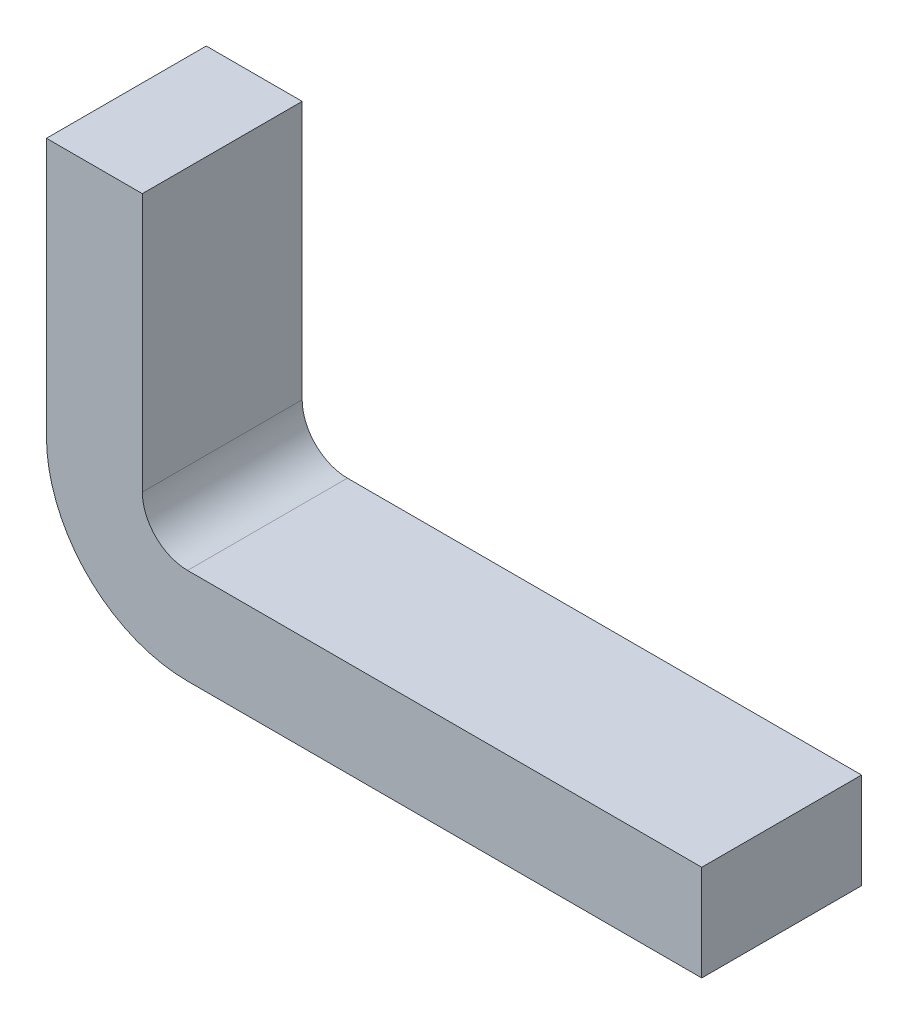
ISO-10303-21;
HEADER;
FILE_DESCRIPTION(('STEP AP214'),'2;1');
FILE_NAME('part.step','',(''),(''),'','','');
FILE_SCHEMA(('AUTOMOTIVE_DESIGN { 1 0 10303 214 1 1 1 1 }'));
ENDSEC;
DATA;
#1=APPLICATION_CONTEXT('core data for automotive mechanical design processes');
#2=APPLICATION_PROTOCOL_DEFINITION('international standard','automotive_design',2000,#1);
#3=PRODUCT_CONTEXT('',#1,'mechanical');
#4=PRODUCT('Part','Part','',(#3));
#5=PRODUCT_RELATED_PRODUCT_CATEGORY('part','',(#4));
#6=PRODUCT_DEFINITION_FORMATION('','',#4);
#7=PRODUCT_DEFINITION_CONTEXT('part definition',#1,'design');
#8=PRODUCT_DEFINITION('design','',#6,#7);
#9=PRODUCT_DEFINITION_SHAPE('','',#8);
#10=(LENGTH_UNIT() NAMED_UNIT(*) SI_UNIT(.MILLI.,.METRE.));
#11=(NAMED_UNIT(*) PLANE_ANGLE_UNIT() SI_UNIT($,.RADIAN.));
#12=(NAMED_UNIT(*) SI_UNIT($,.STERADIAN.) SOLID_ANGLE_UNIT());
#13=UNCERTAINTY_MEASURE_WITH_UNIT(LENGTH_MEASURE(1.E-05),#10,'distance_accuracy_value','');
#14=(GEOMETRIC_REPRESENTATION_CONTEXT(3) GLOBAL_UNCERTAINTY_ASSIGNED_CONTEXT((#13)) GLOBAL_UNIT_ASSIGNED_CONTEXT((#10,
#11,#12)) REPRESENTATION_CONTEXT('',''));
#15=CARTESIAN_POINT('',(0.,0.,0.));
#16=DIRECTION('',(0.,0.,1.));
#17=DIRECTION('',(1.,0.,0.));
#18=AXIS2_PLACEMENT_3D('',#15,#16,#17);
#19=CARTESIAN_POINT('',(1.89999999999999,0.300000000012247,0.25));
#20=DIRECTION('',(-1.,0.,0.));
#21=DIRECTION('',(0.,0.,1.));
#22=AXIS2_PLACEMENT_3D('',#19,#20,#21);
#23=PLANE('',#22);
#24=DIRECTION('',(0.,0.,-1.));
#25=VECTOR('',#24,1.);
#26=CARTESIAN_POINT('',(1.89999999999999,0.,0.25));
#27=LINE('',#26,#25);
#28=CARTESIAN_POINT('',(1.89999999999999,0.,0.25));
#29=VERTEX_POINT('',#28);
#30=CARTESIAN_POINT('',(1.89999999999999,0.,-0.25));
#31=VERTEX_POINT('',#30);
#32=EDGE_CURVE('E121',#29,#31,#27,.T.);
#33=ORIENTED_EDGE('',*,*,#32,.T.);
#34=DIRECTION('',(0.,1.,0.));
#35=VECTOR('',#34,1.);
#36=CARTESIAN_POINT('',(1.89999999999999,0.300000000012247,-0.25));
#37=LINE('',#36,#35);
#38=CARTESIAN_POINT('',(1.89999999999999,0.300000000012247,-0.25));
#39=VERTEX_POINT('',#38);
#40=EDGE_CURVE('E114',#31,#39,#37,.T.);
#41=ORIENTED_EDGE('',*,*,#40,.T.);
#42=DIRECTION('',(0.,0.,-1.));
#43=VECTOR('',#42,1.);
#44=CARTESIAN_POINT('',(1.89999999999999,0.300000000012247,0.25));
#45=LINE('',#44,#43);
#46=CARTESIAN_POINT('',(1.89999999999999,0.300000000012247,0.25));
#47=VERTEX_POINT('',#46);
#48=EDGE_CURVE('E11',#47,#39,#45,.T.);
#49=ORIENTED_EDGE('',*,*,#48,.F.);
#50=DIRECTION('',(0.,1.,0.));
#51=VECTOR('',#50,1.);
#52=CARTESIAN_POINT('',(1.89999999999999,0.300000000012247,0.25));
#53=LINE('',#52,#51);
#54=EDGE_CURVE('E148',#29,#47,#53,.T.);
#55=ORIENTED_EDGE('',*,*,#54,.F.);
#56=EDGE_LOOP('',(#33,#41,#49,#55));
#57=FACE_BOUND('',#56,.T.);
#58=ADVANCED_FACE('F37',(#57),#23,.F.);
#59=CARTESIAN_POINT('',(1.89999999999999,0.300000000012247,0.25));
#60=DIRECTION('',(0.,-1.,0.));
#61=DIRECTION('',(1.,0.,0.));
#62=AXIS2_PLACEMENT_3D('',#59,#60,#61);
#63=PLANE('',#62);
#64=ORIENTED_EDGE('',*,*,#48,.T.);
#65=DIRECTION('',(-1.,0.,0.));
#66=VECTOR('',#65,1.);
#67=CARTESIAN_POINT('',(1.89999999999999,0.300000000012247,-0.25));
#68=LINE('',#67,#66);
#69=CARTESIAN_POINT('',(0.291547594745416,0.300000000012247,-0.25));
#70=VERTEX_POINT('',#69);
#71=EDGE_CURVE('E104',#39,#70,#68,.T.);
#72=ORIENTED_EDGE('',*,*,#71,.T.);
#73=DIRECTION('',(0.,0.,-1.));
#74=VECTOR('',#73,1.);
#75=CARTESIAN_POINT('',(0.291547594745416,0.300000000012247,0.25));
#76=LINE('',#75,#74);
#77=CARTESIAN_POINT('',(0.291547594745416,0.300000000012247,0.25));
#78=VERTEX_POINT('',#77);
#79=EDGE_CURVE('E45',#78,#70,#76,.T.);
#80=ORIENTED_EDGE('',*,*,#79,.F.);
#81=DIRECTION('',(-1.,0.,0.));
#82=VECTOR('',#81,1.);
#83=CARTESIAN_POINT('',(1.89999999999999,0.300000000012247,0.25));
#84=LINE('',#83,#82);
#85=EDGE_CURVE('E105',#47,#78,#84,.T.);
#86=ORIENTED_EDGE('',*,*,#85,.F.);
#87=EDGE_LOOP('',(#64,#72,#80,#86));
#88=FACE_BOUND('',#87,.T.);
#89=ADVANCED_FACE('F102',(#88),#63,.F.);
#90=CARTESIAN_POINT('',(0.291547594745416,0.441547594751539,0.25));
#91=DIRECTION('',(0.,0.,-1.));
#92=DIRECTION('',(-1.,0.,0.));
#93=AXIS2_PLACEMENT_3D('',#90,#91,#92);
#94=CYLINDRICAL_SURFACE('',#93,0.141547594739293);
#95=ORIENTED_EDGE('',*,*,#79,.T.);
#96=CARTESIAN_POINT('',(0.291547594745416,0.441547594751539,-0.25));
#97=DIRECTION('',(0.,0.,-1.));
#98=DIRECTION('',(-1.,0.,0.));
#99=AXIS2_PLACEMENT_3D('',#96,#97,#98);
#100=CIRCLE('',#99,0.141547594739293);
#101=CARTESIAN_POINT('',(0.150000000006123,0.441547594751539,-0.25));
#102=VERTEX_POINT('',#101);
#103=EDGE_CURVE('E118',#70,#102,#100,.T.);
#104=ORIENTED_EDGE('',*,*,#103,.T.);
#105=DIRECTION('',(0.,0.,-1.));
#106=VECTOR('',#105,1.);
#107=CARTESIAN_POINT('',(0.150000000006123,0.441547594751539,0.25));
#108=LINE('',#107,#106);
#109=CARTESIAN_POINT('',(0.150000000006123,0.441547594751539,0.25));
#110=VERTEX_POINT('',#109);
#111=EDGE_CURVE('E181',#110,#102,#108,.T.);
#112=ORIENTED_EDGE('',*,*,#111,.F.);
#113=CARTESIAN_POINT('',(0.291547594745416,0.441547594751539,0.25));
#114=DIRECTION('',(0.,0.,-1.));
#115=DIRECTION('',(-1.,0.,0.));
#116=AXIS2_PLACEMENT_3D('',#113,#114,#115);
#117=CIRCLE('',#116,0.141547594739293);
#118=EDGE_CURVE('E153',#78,#110,#117,.T.);
#119=ORIENTED_EDGE('',*,*,#118,.F.);
#120=EDGE_LOOP('',(#95,#104,#112,#119));
#121=FACE_BOUND('',#120,.T.);
#122=ADVANCED_FACE('F186',(#121),#94,.F.);
#123=CARTESIAN_POINT('',(0.150000000006123,0.441547594751539,0.25));
#124=DIRECTION('',(-1.,0.,0.));
#125=DIRECTION('',(0.,-1.,0.));
#126=AXIS2_PLACEMENT_3D('',#123,#124,#125);
#127=PLANE('',#126);
#128=ORIENTED_EDGE('',*,*,#111,.T.);
#129=DIRECTION('',(0.,1.,0.));
#130=VECTOR('',#129,1.);
#131=CARTESIAN_POINT('',(0.150000000006123,0.441547594751539,-0.25));
#132=LINE('',#131,#130);
#133=CARTESIAN_POINT('',(0.150000000006123,1.25000000002449,-0.25));
#134=VERTEX_POINT('',#133);
#135=EDGE_CURVE('E129',#102,#134,#132,.T.);
#136=ORIENTED_EDGE('',*,*,#135,.T.);
#137=DIRECTION('',(0.,0.,-1.));
#138=VECTOR('',#137,1.);
#139=CARTESIAN_POINT('',(0.150000000006123,1.25000000002449,0.25));
#140=LINE('',#139,#138);
#141=CARTESIAN_POINT('',(0.150000000006123,1.25000000002449,0.25));
#142=VERTEX_POINT('',#141);
#143=EDGE_CURVE('E178',#142,#134,#140,.T.);
#144=ORIENTED_EDGE('',*,*,#143,.F.);
#145=DIRECTION('',(0.,1.,0.));
#146=VECTOR('',#145,1.);
#147=CARTESIAN_POINT('',(0.150000000006123,0.441547594751539,0.25));
#148=LINE('',#147,#146);
#149=EDGE_CURVE('E156',#110,#142,#148,.T.);
#150=ORIENTED_EDGE('',*,*,#149,.F.);
#151=EDGE_LOOP('',(#128,#136,#144,#150));
#152=FACE_BOUND('',#151,.T.);
#153=ADVANCED_FACE('F194',(#152),#127,.F.);
#154=CARTESIAN_POINT('',(0.150000000006123,1.25000000002449,0.25));
#155=DIRECTION('',(0.,-1.,0.));
#156=DIRECTION('',(0.,0.,-1.));
#157=AXIS2_PLACEMENT_3D('',#154,#155,#156);
#158=PLANE('',#157);
#159=ORIENTED_EDGE('',*,*,#143,.T.);
#160=DIRECTION('',(-1.,0.,0.));
#161=VECTOR('',#160,1.);
#162=CARTESIAN_POINT('',(0.150000000006123,1.25000000002449,-0.25));
#163=LINE('',#162,#161);
#164=CARTESIAN_POINT('',(-0.150000000006124,1.25000000002449,-0.25));
#165=VERTEX_POINT('',#164);
#166=EDGE_CURVE('E133',#134,#165,#163,.T.);
#167=ORIENTED_EDGE('',*,*,#166,.T.);
#168=DIRECTION('',(0.,0.,-1.));
#169=VECTOR('',#168,1.);
#170=CARTESIAN_POINT('',(-0.150000000006124,1.25000000002449,0.25));
#171=LINE('',#170,#169);
#172=CARTESIAN_POINT('',(-0.150000000006124,1.25000000002449,0.25));
#173=VERTEX_POINT('',#172);
#174=EDGE_CURVE('E175',#173,#165,#171,.T.);
#175=ORIENTED_EDGE('',*,*,#174,.F.);
#176=DIRECTION('',(-1.,0.,0.));
#177=VECTOR('',#176,1.);
#178=CARTESIAN_POINT('',(0.150000000006123,1.25000000002449,0.25));
#179=LINE('',#178,#177);
#180=EDGE_CURVE('E159',#142,#173,#179,.T.);
#181=ORIENTED_EDGE('',*,*,#180,.F.);
#182=EDGE_LOOP('',(#159,#167,#175,#181));
#183=FACE_BOUND('',#182,.T.);
#184=ADVANCED_FACE('F197',(#183),#158,.F.);
#185=CARTESIAN_POINT('',(-0.150000000006123,0.441547594751539,0.25));
#186=DIRECTION('',(1.,0.,0.));
#187=DIRECTION('',(0.,1.,0.));
#188=AXIS2_PLACEMENT_3D('',#185,#186,#187);
#189=PLANE('',#188);
#190=ORIENTED_EDGE('',*,*,#174,.T.);
#191=DIRECTION('',(0.,-1.,0.));
#192=VECTOR('',#191,1.);
#193=CARTESIAN_POINT('',(-0.150000000006123,0.441547594751539,-0.25));
#194=LINE('',#193,#192);
#195=CARTESIAN_POINT('',(-0.150000000006123,0.441547594751539,-0.25));
#196=VERTEX_POINT('',#195);
#197=EDGE_CURVE('E137',#165,#196,#194,.T.);
#198=ORIENTED_EDGE('',*,*,#197,.T.);
#199=DIRECTION('',(0.,0.,-1.));
#200=VECTOR('',#199,1.);
#201=CARTESIAN_POINT('',(-0.150000000006123,0.441547594751539,0.25));
#202=LINE('',#201,#200);
#203=CARTESIAN_POINT('',(-0.150000000006123,0.441547594751539,0.25));
#204=VERTEX_POINT('',#203);
#205=EDGE_CURVE('E172',#204,#196,#202,.T.);
#206=ORIENTED_EDGE('',*,*,#205,.F.);
#207=DIRECTION('',(0.,-1.,0.));
#208=VECTOR('',#207,1.);
#209=CARTESIAN_POINT('',(-0.150000000006123,0.441547594751539,0.25));
#210=LINE('',#209,#208);
#211=EDGE_CURVE('E161',#173,#204,#210,.T.);
#212=ORIENTED_EDGE('',*,*,#211,.F.);
#213=EDGE_LOOP('',(#190,#198,#206,#212));
#214=FACE_BOUND('',#213,.T.);
#215=ADVANCED_FACE('F202',(#214),#189,.F.);
#216=CARTESIAN_POINT('',(0.291547594745416,0.441547594751539,0.25));
#217=DIRECTION('',(0.,0.,-1.));
#218=DIRECTION('',(-1.,0.,0.));
#219=AXIS2_PLACEMENT_3D('',#216,#217,#218);
#220=CYLINDRICAL_SURFACE('',#219,0.44154759475154);
#221=ORIENTED_EDGE('',*,*,#205,.T.);
#222=CARTESIAN_POINT('',(0.291547594745416,0.441547594751539,-0.25));
#223=DIRECTION('',(0.,0.,1.));
#224=DIRECTION('',(-1.,0.,0.));
#225=AXIS2_PLACEMENT_3D('',#222,#223,#224);
#226=CIRCLE('',#225,0.44154759475154);
#227=CARTESIAN_POINT('',(0.291547594745416,0.,-0.25));
#228=VERTEX_POINT('',#227);
#229=EDGE_CURVE('E141',#196,#228,#226,.T.);
#230=ORIENTED_EDGE('',*,*,#229,.T.);
#231=DIRECTION('',(0.,0.,-1.));
#232=VECTOR('',#231,1.);
#233=CARTESIAN_POINT('',(0.291547594745416,0.,0.25));
#234=LINE('',#233,#232);
#235=CARTESIAN_POINT('',(0.291547594745416,0.,0.25));
#236=VERTEX_POINT('',#235);
#237=EDGE_CURVE('E170',#236,#228,#234,.T.);
#238=ORIENTED_EDGE('',*,*,#237,.F.);
#239=CARTESIAN_POINT('',(0.291547594745416,0.441547594751539,0.25));
#240=DIRECTION('',(0.,0.,1.));
#241=DIRECTION('',(-1.,0.,0.));
#242=AXIS2_PLACEMENT_3D('',#239,#240,#241);
#243=CIRCLE('',#242,0.44154759475154);
#244=EDGE_CURVE('E57',#204,#236,#243,.T.);
#245=ORIENTED_EDGE('',*,*,#244,.F.);
#246=EDGE_LOOP('',(#221,#230,#238,#245));
#247=FACE_BOUND('',#246,.T.);
#248=ADVANCED_FACE('F205',(#247),#220,.T.);
#249=CARTESIAN_POINT('',(1.89999999999999,0.,0.25));
#250=DIRECTION('',(0.,1.,0.));
#251=DIRECTION('',(-1.,0.,0.));
#252=AXIS2_PLACEMENT_3D('',#249,#250,#251);
#253=PLANE('',#252);
#254=ORIENTED_EDGE('',*,*,#237,.T.);
#255=DIRECTION('',(1.,0.,0.));
#256=VECTOR('',#255,1.);
#257=CARTESIAN_POINT('',(1.89999999999999,0.,-0.25));
#258=LINE('',#257,#256);
#259=EDGE_CURVE('E145',#228,#31,#258,.T.);
#260=ORIENTED_EDGE('',*,*,#259,.T.);
#261=ORIENTED_EDGE('',*,*,#32,.F.);
#262=DIRECTION('',(1.,0.,0.));
#263=VECTOR('',#262,1.);
#264=CARTESIAN_POINT('',(1.89999999999999,0.,0.25));
#265=LINE('',#264,#263);
#266=EDGE_CURVE('E52',#236,#29,#265,.T.);
#267=ORIENTED_EDGE('',*,*,#266,.F.);
#268=EDGE_LOOP('',(#254,#260,#261,#267));
#269=FACE_BOUND('',#268,.T.);
#270=ADVANCED_FACE('F207',(#269),#253,.F.);
#271=CARTESIAN_POINT('',(0.291547594745416,0.441547594751539,0.25));
#272=DIRECTION('',(0.,0.,-1.));
#273=DIRECTION('',(-1.,0.,0.));
#274=AXIS2_PLACEMENT_3D('',#271,#272,#273);
#275=PLANE('',#274);
#276=ORIENTED_EDGE('',*,*,#54,.T.);
#277=ORIENTED_EDGE('',*,*,#85,.T.);
#278=ORIENTED_EDGE('',*,*,#118,.T.);
#279=ORIENTED_EDGE('',*,*,#149,.T.);
#280=ORIENTED_EDGE('',*,*,#180,.T.);
#281=ORIENTED_EDGE('',*,*,#211,.T.);
#282=ORIENTED_EDGE('',*,*,#244,.T.);
#283=ORIENTED_EDGE('',*,*,#266,.T.);
#284=EDGE_LOOP('',(#276,#277,#278,#279,#280,#281,#282,#283));
#285=FACE_BOUND('',#284,.T.);
#286=ADVANCED_FACE('F189',(#285),#275,.F.);
#287=CARTESIAN_POINT('',(0.291547594745416,0.441547594751539,-0.25));
#288=DIRECTION('',(0.,0.,-1.));
#289=DIRECTION('',(-1.,0.,0.));
#290=AXIS2_PLACEMENT_3D('',#287,#288,#289);
#291=PLANE('',#290);
#292=ORIENTED_EDGE('',*,*,#40,.F.);
#293=ORIENTED_EDGE('',*,*,#259,.F.);
#294=ORIENTED_EDGE('',*,*,#229,.F.);
#295=ORIENTED_EDGE('',*,*,#197,.F.);
#296=ORIENTED_EDGE('',*,*,#166,.F.);
#297=ORIENTED_EDGE('',*,*,#135,.F.);
#298=ORIENTED_EDGE('',*,*,#103,.F.);
#299=ORIENTED_EDGE('',*,*,#71,.F.);
#300=EDGE_LOOP('',(#292,#293,#294,#295,#296,#297,#298,#299));
#301=FACE_BOUND('',#300,.T.);
#302=ADVANCED_FACE('F112',(#301),#291,.T.);
#303=CLOSED_SHELL('',(#58,#89,#122,#153,#184,#215,#248,#270,#286,#302));
#304=MANIFOLD_SOLID_BREP('B2',#303);
#305=ADVANCED_BREP_SHAPE_REPRESENTATION('',(#18,#304),#14);
#306=SHAPE_DEFINITION_REPRESENTATION(#9,#305);
ENDSEC;
END-ISO-10303-21;
